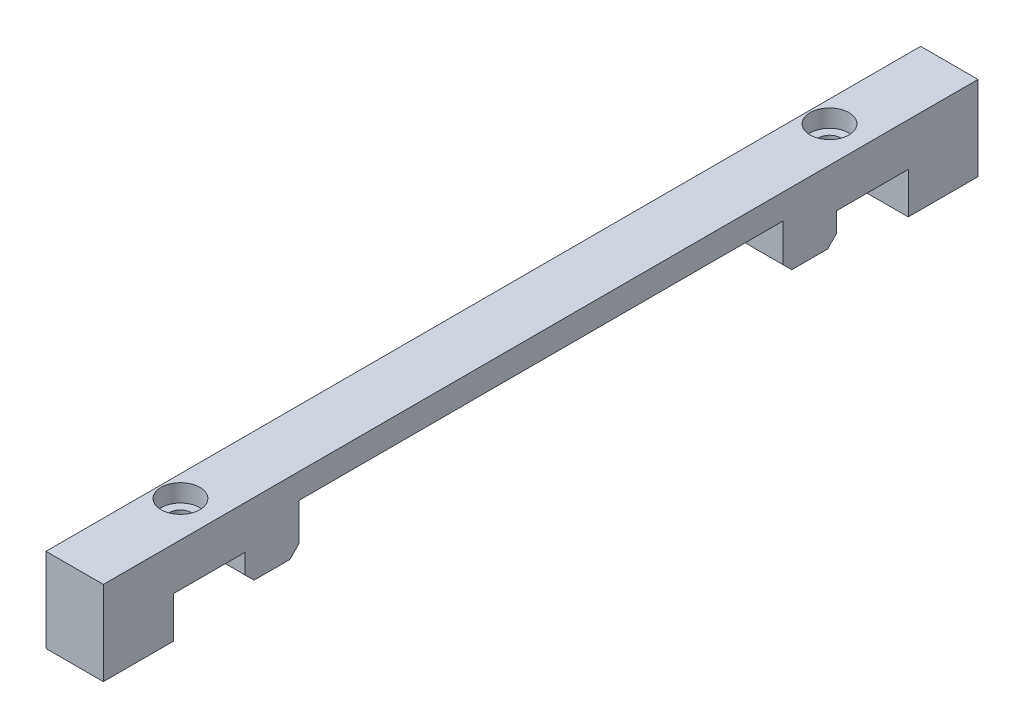
ISO-10303-21;
HEADER;
FILE_DESCRIPTION(('STEP AP214'),'2;1');
FILE_NAME('part.step','',(''),(''),'','','');
FILE_SCHEMA(('AUTOMOTIVE_DESIGN { 1 0 10303 214 1 1 1 1 }'));
ENDSEC;
DATA;
#1=APPLICATION_CONTEXT('core data for automotive mechanical design processes');
#2=APPLICATION_PROTOCOL_DEFINITION('international standard','automotive_design',2000,#1);
#3=PRODUCT_CONTEXT('',#1,'mechanical');
#4=PRODUCT('Part','Part','',(#3));
#5=PRODUCT_RELATED_PRODUCT_CATEGORY('part','',(#4));
#6=PRODUCT_DEFINITION_FORMATION('','',#4);
#7=PRODUCT_DEFINITION_CONTEXT('part definition',#1,'design');
#8=PRODUCT_DEFINITION('design','',#6,#7);
#9=PRODUCT_DEFINITION_SHAPE('','',#8);
#10=(LENGTH_UNIT() NAMED_UNIT(*) SI_UNIT(.MILLI.,.METRE.));
#11=(NAMED_UNIT(*) PLANE_ANGLE_UNIT() SI_UNIT($,.RADIAN.));
#12=(NAMED_UNIT(*) SI_UNIT($,.STERADIAN.) SOLID_ANGLE_UNIT());
#13=UNCERTAINTY_MEASURE_WITH_UNIT(LENGTH_MEASURE(1.E-05),#10,'distance_accuracy_value','');
#14=(GEOMETRIC_REPRESENTATION_CONTEXT(3) GLOBAL_UNCERTAINTY_ASSIGNED_CONTEXT((#13)) GLOBAL_UNIT_ASSIGNED_CONTEXT((#10,
#11,#12)) REPRESENTATION_CONTEXT('',''));
#15=CARTESIAN_POINT('',(0.,0.,0.));
#16=DIRECTION('',(0.,0.,1.));
#17=DIRECTION('',(1.,0.,0.));
#18=AXIS2_PLACEMENT_3D('',#15,#16,#17);
#19=CARTESIAN_POINT('',(4.06399999999999,18.288,-63.5));
#20=DIRECTION('',(-1.,0.,0.));
#21=DIRECTION('',(0.,0.,1.));
#22=AXIS2_PLACEMENT_3D('',#19,#20,#21);
#23=PLANE('',#22);
#24=DIRECTION('',(0.,0.,-1.));
#25=VECTOR('',#24,1.);
#26=CARTESIAN_POINT('',(4.06399999999999,18.288,-63.5));
#27=LINE('',#26,#25);
#28=CARTESIAN_POINT('',(4.06399999999999,18.288,61.9922717194262));
#29=VERTEX_POINT('',#28);
#30=CARTESIAN_POINT('',(4.06399999999999,18.288,-61.9535592267789));
#31=VERTEX_POINT('',#30);
#32=EDGE_CURVE('E207',#29,#31,#27,.T.);
#33=ORIENTED_EDGE('',*,*,#32,.F.);
#34=DIRECTION('',(0.,-1.,0.));
#35=VECTOR('',#34,1.);
#36=CARTESIAN_POINT('',(4.06399999999999,18.288,61.9922717194262));
#37=LINE('',#36,#35);
#38=CARTESIAN_POINT('',(4.06399999999999,6.35,61.9922717194262));
#39=VERTEX_POINT('',#38);
#40=EDGE_CURVE('E187',#29,#39,#37,.T.);
#41=ORIENTED_EDGE('',*,*,#40,.T.);
#42=DIRECTION('',(0.,0.,1.));
#43=VECTOR('',#42,1.);
#44=CARTESIAN_POINT('',(4.06399999999999,6.35,63.5));
#45=LINE('',#44,#43);
#46=CARTESIAN_POINT('',(4.06399999999999,6.35,52.07));
#47=VERTEX_POINT('',#46);
#48=EDGE_CURVE('E728',#47,#39,#45,.T.);
#49=ORIENTED_EDGE('',*,*,#48,.F.);
#50=DIRECTION('',(0.,-1.,0.));
#51=VECTOR('',#50,1.);
#52=CARTESIAN_POINT('',(4.06400000000001,8.128,52.07));
#53=LINE('',#52,#51);
#54=CARTESIAN_POINT('',(4.06400000000001,12.192,52.07));
#55=VERTEX_POINT('',#54);
#56=EDGE_CURVE('E314',#55,#47,#53,.T.);
#57=ORIENTED_EDGE('',*,*,#56,.F.);
#58=DIRECTION('',(0.,0.,-1.));
#59=VECTOR('',#58,1.);
#60=CARTESIAN_POINT('',(4.06400000000001,12.192,41.91));
#61=LINE('',#60,#59);
#62=CARTESIAN_POINT('',(4.06400000000001,12.192,41.91));
#63=VERTEX_POINT('',#62);
#64=EDGE_CURVE('E340',#55,#63,#61,.T.);
#65=ORIENTED_EDGE('',*,*,#64,.T.);
#66=DIRECTION('',(0.,-1.,0.));
#67=VECTOR('',#66,1.);
#68=CARTESIAN_POINT('',(4.06400000000001,12.192,41.91));
#69=LINE('',#68,#67);
#70=CARTESIAN_POINT('',(4.06400000000001,9.39800000000001,41.91));
#71=VERTEX_POINT('',#70);
#72=EDGE_CURVE('E354',#63,#71,#69,.T.);
#73=ORIENTED_EDGE('',*,*,#72,.T.);
#74=DIRECTION('',(0.,0.707106781186551,0.707106781186544));
#75=VECTOR('',#74,1.);
#76=CARTESIAN_POINT('',(4.064,8.128,40.64));
#77=LINE('',#76,#75);
#78=CARTESIAN_POINT('',(4.06400000000001,8.128,40.64));
#79=VERTEX_POINT('',#78);
#80=EDGE_CURVE('E234',#71,#79,#77,.F.);
#81=ORIENTED_EDGE('',*,*,#80,.T.);
#82=DIRECTION('',(0.,0.,1.));
#83=VECTOR('',#82,1.);
#84=CARTESIAN_POINT('',(4.06400000000001,8.128,52.07));
#85=LINE('',#84,#83);
#86=CARTESIAN_POINT('',(4.06400000000001,8.128,35.56));
#87=VERTEX_POINT('',#86);
#88=EDGE_CURVE('E303',#87,#79,#85,.T.);
#89=ORIENTED_EDGE('',*,*,#88,.F.);
#90=DIRECTION('',(0.,-0.707106781186551,0.707106781186544));
#91=VECTOR('',#90,1.);
#92=CARTESIAN_POINT('',(4.064,8.128,35.56));
#93=LINE('',#92,#91);
#94=CARTESIAN_POINT('',(4.06400000000001,9.39800000000001,34.29));
#95=VERTEX_POINT('',#94);
#96=EDGE_CURVE('E236',#87,#95,#93,.F.);
#97=ORIENTED_EDGE('',*,*,#96,.T.);
#98=DIRECTION('',(0.,-1.,0.));
#99=VECTOR('',#98,1.);
#100=CARTESIAN_POINT('',(4.06400000000001,14.732,34.29));
#101=LINE('',#100,#99);
#102=CARTESIAN_POINT('',(4.06400000000001,14.732,34.29));
#103=VERTEX_POINT('',#102);
#104=EDGE_CURVE('E331',#103,#95,#101,.T.);
#105=ORIENTED_EDGE('',*,*,#104,.F.);
#106=DIRECTION('',(0.,0.,1.));
#107=VECTOR('',#106,1.);
#108=CARTESIAN_POINT('',(4.06400000000001,14.732,0.));
#109=LINE('',#108,#107);
#110=CARTESIAN_POINT('',(4.06400000000001,14.732,-34.29));
#111=VERTEX_POINT('',#110);
#112=EDGE_CURVE('E218',#111,#103,#109,.T.);
#113=ORIENTED_EDGE('',*,*,#112,.F.);
#114=DIRECTION('',(0.,-1.,0.));
#115=VECTOR('',#114,1.);
#116=CARTESIAN_POINT('',(4.06400000000001,14.732,-34.29));
#117=LINE('',#116,#115);
#118=CARTESIAN_POINT('',(4.06400000000001,9.39800000000002,-34.29));
#119=VERTEX_POINT('',#118);
#120=EDGE_CURVE('E276',#111,#119,#117,.T.);
#121=ORIENTED_EDGE('',*,*,#120,.T.);
#122=DIRECTION('',(0.,-0.707106781186544,-0.707106781186551));
#123=VECTOR('',#122,1.);
#124=CARTESIAN_POINT('',(4.06400000000001,9.39800000000002,-34.29));
#125=LINE('',#124,#123);
#126=CARTESIAN_POINT('',(4.06400000000001,8.128,-35.56));
#127=VERTEX_POINT('',#126);
#128=EDGE_CURVE('E232',#119,#127,#125,.T.);
#129=ORIENTED_EDGE('',*,*,#128,.T.);
#130=CARTESIAN_POINT('',(4.06400000000001,8.128,-40.64));
#131=VERTEX_POINT('',#130);
#132=EDGE_CURVE('E262',#131,#127,#85,.T.);
#133=ORIENTED_EDGE('',*,*,#132,.F.);
#134=DIRECTION('',(0.,0.707106781186544,-0.707106781186551));
#135=VECTOR('',#134,1.);
#136=CARTESIAN_POINT('',(4.064,9.39800000000002,-41.91));
#137=LINE('',#136,#135);
#138=CARTESIAN_POINT('',(4.06400000000001,9.39800000000002,-41.91));
#139=VERTEX_POINT('',#138);
#140=EDGE_CURVE('E230',#131,#139,#137,.T.);
#141=ORIENTED_EDGE('',*,*,#140,.T.);
#142=DIRECTION('',(0.,-1.,0.));
#143=VECTOR('',#142,1.);
#144=CARTESIAN_POINT('',(4.06400000000001,12.192,-41.91));
#145=LINE('',#144,#143);
#146=CARTESIAN_POINT('',(4.06400000000001,12.192,-41.91));
#147=VERTEX_POINT('',#146);
#148=EDGE_CURVE('E300',#147,#139,#145,.T.);
#149=ORIENTED_EDGE('',*,*,#148,.F.);
#150=DIRECTION('',(0.,0.,1.));
#151=VECTOR('',#150,1.);
#152=CARTESIAN_POINT('',(4.06400000000001,12.192,-41.91));
#153=LINE('',#152,#151);
#154=CARTESIAN_POINT('',(4.06400000000001,12.192,-52.07));
#155=VERTEX_POINT('',#154);
#156=EDGE_CURVE('E282',#155,#147,#153,.T.);
#157=ORIENTED_EDGE('',*,*,#156,.F.);
#158=DIRECTION('',(0.,-1.,0.));
#159=VECTOR('',#158,1.);
#160=CARTESIAN_POINT('',(4.06400000000001,8.128,-52.07));
#161=LINE('',#160,#159);
#162=CARTESIAN_POINT('',(4.06400000000001,6.35,-52.07));
#163=VERTEX_POINT('',#162);
#164=EDGE_CURVE('E211',#155,#163,#161,.T.);
#165=ORIENTED_EDGE('',*,*,#164,.T.);
#166=CARTESIAN_POINT('',(4.06399999999999,6.35,-61.9535592267789));
#167=VERTEX_POINT('',#166);
#168=EDGE_CURVE('E430',#167,#163,#45,.T.);
#169=ORIENTED_EDGE('',*,*,#168,.F.);
#170=DIRECTION('',(0.,-1.,0.));
#171=VECTOR('',#170,1.);
#172=CARTESIAN_POINT('',(4.06399999999999,18.288,-61.9535592267789));
#173=LINE('',#172,#171);
#174=EDGE_CURVE('E65',#31,#167,#173,.T.);
#175=ORIENTED_EDGE('',*,*,#174,.F.);
#176=EDGE_LOOP('',(#33,#41,#49,#57,#65,#73,#81,#89,#97,#105,#113,#121,#129,#133,#141,#149,#157,
#165,#169,#175));
#177=FACE_BOUND('',#176,.T.);
#178=ADVANCED_FACE('F40',(#177),#23,.F.);
#179=CARTESIAN_POINT('',(-4.06400000000001,18.288,-63.5));
#180=DIRECTION('',(1.,0.,0.));
#181=DIRECTION('',(0.,0.,-1.));
#182=AXIS2_PLACEMENT_3D('',#179,#180,#181);
#183=PLANE('',#182);
#184=DIRECTION('',(0.,0.,-1.));
#185=VECTOR('',#184,1.);
#186=CARTESIAN_POINT('',(-4.06399999999999,6.35,63.5));
#187=LINE('',#186,#185);
#188=CARTESIAN_POINT('',(-4.06399999999999,6.35,61.9922717194262));
#189=VERTEX_POINT('',#188);
#190=CARTESIAN_POINT('',(-4.06400000000001,6.35,52.07));
#191=VERTEX_POINT('',#190);
#192=EDGE_CURVE('E200',#189,#191,#187,.T.);
#193=ORIENTED_EDGE('',*,*,#192,.F.);
#194=DIRECTION('',(0.,-1.,0.));
#195=VECTOR('',#194,1.);
#196=CARTESIAN_POINT('',(-4.06399999999999,18.288,61.9922717194262));
#197=LINE('',#196,#195);
#198=CARTESIAN_POINT('',(-4.06399999999999,18.288,61.9922717194262));
#199=VERTEX_POINT('',#198);
#200=EDGE_CURVE('E57',#199,#189,#197,.T.);
#201=ORIENTED_EDGE('',*,*,#200,.F.);
#202=DIRECTION('',(0.,0.,1.));
#203=VECTOR('',#202,1.);
#204=CARTESIAN_POINT('',(-4.06400000000001,18.288,-63.5));
#205=LINE('',#204,#203);
#206=CARTESIAN_POINT('',(-4.06399999999999,18.288,-61.9535592267789));
#207=VERTEX_POINT('',#206);
#208=EDGE_CURVE('E198',#207,#199,#205,.T.);
#209=ORIENTED_EDGE('',*,*,#208,.F.);
#210=DIRECTION('',(0.,-1.,0.));
#211=VECTOR('',#210,1.);
#212=CARTESIAN_POINT('',(-4.06399999999999,18.288,-61.9535592267789));
#213=LINE('',#212,#211);
#214=CARTESIAN_POINT('',(-4.06399999999999,6.35,-61.9535592267789));
#215=VERTEX_POINT('',#214);
#216=EDGE_CURVE('E742',#207,#215,#213,.T.);
#217=ORIENTED_EDGE('',*,*,#216,.T.);
#218=CARTESIAN_POINT('',(-4.06399999999999,6.35,-52.07));
#219=VERTEX_POINT('',#218);
#220=EDGE_CURVE('E730',#219,#215,#187,.T.);
#221=ORIENTED_EDGE('',*,*,#220,.F.);
#222=DIRECTION('',(0.,-1.,0.));
#223=VECTOR('',#222,1.);
#224=CARTESIAN_POINT('',(-4.06400000000001,8.128,-52.07));
#225=LINE('',#224,#223);
#226=CARTESIAN_POINT('',(-4.06400000000001,12.192,-52.07));
#227=VERTEX_POINT('',#226);
#228=EDGE_CURVE('E310',#227,#219,#225,.T.);
#229=ORIENTED_EDGE('',*,*,#228,.F.);
#230=DIRECTION('',(0.,0.,-1.));
#231=VECTOR('',#230,1.);
#232=CARTESIAN_POINT('',(-4.06400000000001,12.192,-41.91));
#233=LINE('',#232,#231);
#234=CARTESIAN_POINT('',(-4.06400000000001,12.192,-41.91));
#235=VERTEX_POINT('',#234);
#236=EDGE_CURVE('E294',#235,#227,#233,.T.);
#237=ORIENTED_EDGE('',*,*,#236,.F.);
#238=DIRECTION('',(0.,-1.,0.));
#239=VECTOR('',#238,1.);
#240=CARTESIAN_POINT('',(-4.06400000000001,12.192,-41.91));
#241=LINE('',#240,#239);
#242=CARTESIAN_POINT('',(-4.06400000000001,9.39800000000002,-41.91));
#243=VERTEX_POINT('',#242);
#244=EDGE_CURVE('E301',#235,#243,#241,.T.);
#245=ORIENTED_EDGE('',*,*,#244,.T.);
#246=DIRECTION('',(0.,-0.707106781186544,0.707106781186551));
#247=VECTOR('',#246,1.);
#248=CARTESIAN_POINT('',(-4.06400000000001,9.39800000000002,-41.91));
#249=LINE('',#248,#247);
#250=CARTESIAN_POINT('',(-4.06400000000001,8.128,-40.64));
#251=VERTEX_POINT('',#250);
#252=EDGE_CURVE('E206',#243,#251,#249,.T.);
#253=ORIENTED_EDGE('',*,*,#252,.T.);
#254=DIRECTION('',(0.,0.,-1.));
#255=VECTOR('',#254,1.);
#256=CARTESIAN_POINT('',(-4.06400000000001,8.128,52.07));
#257=LINE('',#256,#255);
#258=CARTESIAN_POINT('',(-4.06400000000001,8.128,-35.56));
#259=VERTEX_POINT('',#258);
#260=EDGE_CURVE('E259',#259,#251,#257,.T.);
#261=ORIENTED_EDGE('',*,*,#260,.F.);
#262=DIRECTION('',(0.,0.707106781186544,0.707106781186551));
#263=VECTOR('',#262,1.);
#264=CARTESIAN_POINT('',(-4.064,9.39800000000002,-34.29));
#265=LINE('',#264,#263);
#266=CARTESIAN_POINT('',(-4.06400000000001,9.39800000000002,-34.29));
#267=VERTEX_POINT('',#266);
#268=EDGE_CURVE('E209',#259,#267,#265,.T.);
#269=ORIENTED_EDGE('',*,*,#268,.T.);
#270=DIRECTION('',(0.,-1.,0.));
#271=VECTOR('',#270,1.);
#272=CARTESIAN_POINT('',(-4.06400000000001,14.732,-34.29));
#273=LINE('',#272,#271);
#274=CARTESIAN_POINT('',(-4.06400000000001,14.732,-34.29));
#275=VERTEX_POINT('',#274);
#276=EDGE_CURVE('E278',#275,#267,#273,.T.);
#277=ORIENTED_EDGE('',*,*,#276,.F.);
#278=DIRECTION('',(0.,0.,-1.));
#279=VECTOR('',#278,1.);
#280=CARTESIAN_POINT('',(-4.06400000000001,14.732,0.));
#281=LINE('',#280,#279);
#282=CARTESIAN_POINT('',(-4.06400000000001,14.732,34.29));
#283=VERTEX_POINT('',#282);
#284=EDGE_CURVE('E367',#283,#275,#281,.T.);
#285=ORIENTED_EDGE('',*,*,#284,.F.);
#286=DIRECTION('',(0.,-1.,0.));
#287=VECTOR('',#286,1.);
#288=CARTESIAN_POINT('',(-4.06400000000001,14.732,34.29));
#289=LINE('',#288,#287);
#290=CARTESIAN_POINT('',(-4.06400000000001,9.39800000000001,34.29));
#291=VERTEX_POINT('',#290);
#292=EDGE_CURVE('E338',#283,#291,#289,.T.);
#293=ORIENTED_EDGE('',*,*,#292,.T.);
#294=DIRECTION('',(0.,0.707106781186551,-0.707106781186544));
#295=VECTOR('',#294,1.);
#296=CARTESIAN_POINT('',(-4.064,8.128,35.56));
#297=LINE('',#296,#295);
#298=CARTESIAN_POINT('',(-4.06400000000001,8.128,35.56));
#299=VERTEX_POINT('',#298);
#300=EDGE_CURVE('E228',#291,#299,#297,.F.);
#301=ORIENTED_EDGE('',*,*,#300,.T.);
#302=CARTESIAN_POINT('',(-4.06400000000001,8.128,40.64));
#303=VERTEX_POINT('',#302);
#304=EDGE_CURVE('E268',#303,#299,#257,.T.);
#305=ORIENTED_EDGE('',*,*,#304,.F.);
#306=DIRECTION('',(0.,-0.707106781186551,-0.707106781186544));
#307=VECTOR('',#306,1.);
#308=CARTESIAN_POINT('',(-4.06399999999999,8.128,40.64));
#309=LINE('',#308,#307);
#310=CARTESIAN_POINT('',(-4.06400000000001,9.39800000000001,41.91));
#311=VERTEX_POINT('',#310);
#312=EDGE_CURVE('E226',#303,#311,#309,.F.);
#313=ORIENTED_EDGE('',*,*,#312,.T.);
#314=DIRECTION('',(0.,-1.,0.));
#315=VECTOR('',#314,1.);
#316=CARTESIAN_POINT('',(-4.06400000000001,12.192,41.91));
#317=LINE('',#316,#315);
#318=CARTESIAN_POINT('',(-4.06400000000001,12.192,41.91));
#319=VERTEX_POINT('',#318);
#320=EDGE_CURVE('E353',#319,#311,#317,.T.);
#321=ORIENTED_EDGE('',*,*,#320,.F.);
#322=DIRECTION('',(0.,0.,1.));
#323=VECTOR('',#322,1.);
#324=CARTESIAN_POINT('',(-4.06400000000001,12.192,41.91));
#325=LINE('',#324,#323);
#326=CARTESIAN_POINT('',(-4.06400000000001,12.192,52.07));
#327=VERTEX_POINT('',#326);
#328=EDGE_CURVE('E348',#319,#327,#325,.T.);
#329=ORIENTED_EDGE('',*,*,#328,.T.);
#330=DIRECTION('',(0.,-1.,0.));
#331=VECTOR('',#330,1.);
#332=CARTESIAN_POINT('',(-4.06400000000001,8.128,52.07));
#333=LINE('',#332,#331);
#334=EDGE_CURVE('E313',#327,#191,#333,.T.);
#335=ORIENTED_EDGE('',*,*,#334,.T.);
#336=EDGE_LOOP('',(#193,#201,#209,#217,#221,#229,#237,#245,#253,#261,#269,#277,#285,#293,#301,
#305,#313,#321,#329,#335));
#337=FACE_BOUND('',#336,.T.);
#338=ADVANCED_FACE('F196',(#337),#183,.F.);
#339=CARTESIAN_POINT('',(-4.06400000000001,8.128,-52.07));
#340=DIRECTION('',(0.,0.,-1.));
#341=DIRECTION('',(-1.,0.,0.));
#342=AXIS2_PLACEMENT_3D('',#339,#340,#341);
#343=PLANE('',#342);
#344=DIRECTION('',(-1.,0.,0.));
#345=VECTOR('',#344,1.);
#346=CARTESIAN_POINT('',(-4.06400000000001,6.35,-52.07));
#347=LINE('',#346,#345);
#348=EDGE_CURVE('E433',#163,#219,#347,.T.);
#349=ORIENTED_EDGE('',*,*,#348,.F.);
#350=ORIENTED_EDGE('',*,*,#164,.F.);
#351=DIRECTION('',(1.,0.,0.));
#352=VECTOR('',#351,1.);
#353=CARTESIAN_POINT('',(-4.06400000000001,12.192,-52.07));
#354=LINE('',#353,#352);
#355=EDGE_CURVE('E297',#227,#155,#354,.T.);
#356=ORIENTED_EDGE('',*,*,#355,.F.);
#357=ORIENTED_EDGE('',*,*,#228,.T.);
#358=EDGE_LOOP('',(#349,#350,#356,#357));
#359=FACE_BOUND('',#358,.T.);
#360=ADVANCED_FACE('F388',(#359),#343,.F.);
#361=CARTESIAN_POINT('',(-4.06400000000001,8.128,52.07));
#362=DIRECTION('',(0.,0.,1.));
#363=DIRECTION('',(1.,0.,0.));
#364=AXIS2_PLACEMENT_3D('',#361,#362,#363);
#365=PLANE('',#364);
#366=DIRECTION('',(1.,0.,0.));
#367=VECTOR('',#366,1.);
#368=CARTESIAN_POINT('',(-4.06400000000001,6.35,52.07));
#369=LINE('',#368,#367);
#370=EDGE_CURVE('E438',#191,#47,#369,.T.);
#371=ORIENTED_EDGE('',*,*,#370,.F.);
#372=ORIENTED_EDGE('',*,*,#334,.F.);
#373=DIRECTION('',(1.,0.,0.));
#374=VECTOR('',#373,1.);
#375=CARTESIAN_POINT('',(-4.06400000000001,12.192,52.07));
#376=LINE('',#375,#374);
#377=EDGE_CURVE('E346',#327,#55,#376,.T.);
#378=ORIENTED_EDGE('',*,*,#377,.T.);
#379=ORIENTED_EDGE('',*,*,#56,.T.);
#380=EDGE_LOOP('',(#371,#372,#378,#379));
#381=FACE_BOUND('',#380,.T.);
#382=ADVANCED_FACE('F575',(#381),#365,.F.);
#383=CARTESIAN_POINT('',(0.,8.128,0.));
#384=DIRECTION('',(0.,-1.,0.));
#385=DIRECTION('',(0.,0.,-1.));
#386=AXIS2_PLACEMENT_3D('',#383,#384,#385);
#387=PLANE('',#386);
#388=ORIENTED_EDGE('',*,*,#304,.T.);
#389=DIRECTION('',(1.,0.,0.));
#390=VECTOR('',#389,1.);
#391=CARTESIAN_POINT('',(0.,8.128,35.56));
#392=LINE('',#391,#390);
#393=EDGE_CURVE('E241',#299,#87,#392,.T.);
#394=ORIENTED_EDGE('',*,*,#393,.T.);
#395=ORIENTED_EDGE('',*,*,#88,.T.);
#396=DIRECTION('',(-1.,0.,0.));
#397=VECTOR('',#396,1.);
#398=CARTESIAN_POINT('',(0.,8.128,40.64));
#399=LINE('',#398,#397);
#400=EDGE_CURVE('E238',#79,#303,#399,.T.);
#401=ORIENTED_EDGE('',*,*,#400,.T.);
#402=EDGE_LOOP('',(#388,#394,#395,#401));
#403=FACE_BOUND('',#402,.T.);
#404=ADVANCED_FACE('F323',(#403),#387,.T.);
#405=ORIENTED_EDGE('',*,*,#132,.T.);
#406=DIRECTION('',(-1.,0.,0.));
#407=VECTOR('',#406,1.);
#408=CARTESIAN_POINT('',(-4.06400000000001,8.128,-35.56));
#409=LINE('',#408,#407);
#410=EDGE_CURVE('E50',#127,#259,#409,.T.);
#411=ORIENTED_EDGE('',*,*,#410,.T.);
#412=ORIENTED_EDGE('',*,*,#260,.T.);
#413=DIRECTION('',(1.,0.,0.));
#414=VECTOR('',#413,1.);
#415=CARTESIAN_POINT('',(4.06400000000001,8.128,-40.64));
#416=LINE('',#415,#414);
#417=EDGE_CURVE('E251',#251,#131,#416,.T.);
#418=ORIENTED_EDGE('',*,*,#417,.T.);
#419=EDGE_LOOP('',(#405,#411,#412,#418));
#420=FACE_BOUND('',#419,.T.);
#421=ADVANCED_FACE('F258',(#420),#387,.T.);
#422=CARTESIAN_POINT('',(0.,18.288,0.));
#423=DIRECTION('',(0.,1.,0.));
#424=DIRECTION('',(0.,0.,1.));
#425=AXIS2_PLACEMENT_3D('',#422,#423,#424);
#426=PLANE('',#425);
#427=DIRECTION('',(1.,0.,0.));
#428=VECTOR('',#427,1.);
#429=CARTESIAN_POINT('',(4.06399999999999,18.288,61.9922717194262));
#430=LINE('',#429,#428);
#431=EDGE_CURVE('E184',#199,#29,#430,.T.);
#432=ORIENTED_EDGE('',*,*,#431,.T.);
#433=ORIENTED_EDGE('',*,*,#32,.T.);
#434=DIRECTION('',(-1.,0.,0.));
#435=VECTOR('',#434,1.);
#436=CARTESIAN_POINT('',(4.06399999999999,18.288,-61.9535592267789));
#437=LINE('',#436,#435);
#438=EDGE_CURVE('E205',#31,#207,#437,.T.);
#439=ORIENTED_EDGE('',*,*,#438,.T.);
#440=ORIENTED_EDGE('',*,*,#208,.T.);
#441=EDGE_LOOP('',(#432,#433,#439,#440));
#442=FACE_BOUND('',#441,.T.);
#443=CARTESIAN_POINT('',(-1.01599999999999,18.288,45.99));
#444=DIRECTION('',(0.,1.,0.));
#445=DIRECTION('',(0.,0.,1.));
#446=AXIS2_PLACEMENT_3D('',#443,#444,#445);
#447=CIRCLE('',#446,2.75);
#448=CARTESIAN_POINT('',(-1.01599999999999,18.288,48.74));
#449=VERTEX_POINT('',#448);
#450=EDGE_CURVE('E449',#449,#449,#447,.T.);
#451=ORIENTED_EDGE('',*,*,#450,.F.);
#452=EDGE_LOOP('',(#451));
#453=FACE_BOUND('',#452,.T.);
#454=CARTESIAN_POINT('',(-1.01599999999999,18.288,-45.99));
#455=DIRECTION('',(0.,1.,0.));
#456=DIRECTION('',(0.,0.,1.));
#457=AXIS2_PLACEMENT_3D('',#454,#455,#456);
#458=CIRCLE('',#457,2.75);
#459=CARTESIAN_POINT('',(-1.01599999999999,18.288,-43.24));
#460=VERTEX_POINT('',#459);
#461=EDGE_CURVE('E357',#460,#460,#458,.T.);
#462=ORIENTED_EDGE('',*,*,#461,.F.);
#463=EDGE_LOOP('',(#462));
#464=FACE_BOUND('',#463,.T.);
#465=ADVANCED_FACE('F203',(#442,#453,#464),#426,.T.);
#466=CARTESIAN_POINT('',(-4.06400000000001,12.192,-41.91));
#467=DIRECTION('',(0.,0.,1.));
#468=DIRECTION('',(1.,0.,0.));
#469=AXIS2_PLACEMENT_3D('',#466,#467,#468);
#470=PLANE('',#469);
#471=ORIENTED_EDGE('',*,*,#148,.T.);
#472=DIRECTION('',(-1.,0.,0.));
#473=VECTOR('',#472,1.);
#474=CARTESIAN_POINT('',(-4.06400000000001,9.39800000000002,-41.91));
#475=LINE('',#474,#473);
#476=EDGE_CURVE('E11',#139,#243,#475,.T.);
#477=ORIENTED_EDGE('',*,*,#476,.T.);
#478=ORIENTED_EDGE('',*,*,#244,.F.);
#479=DIRECTION('',(-1.,0.,0.));
#480=VECTOR('',#479,1.);
#481=CARTESIAN_POINT('',(-4.06400000000001,12.192,-41.91));
#482=LINE('',#481,#480);
#483=EDGE_CURVE('E285',#147,#235,#482,.T.);
#484=ORIENTED_EDGE('',*,*,#483,.F.);
#485=EDGE_LOOP('',(#471,#477,#478,#484));
#486=FACE_BOUND('',#485,.T.);
#487=ADVANCED_FACE('F425',(#486),#470,.F.);
#488=CARTESIAN_POINT('',(0.,12.192,0.));
#489=DIRECTION('',(0.,-1.,0.));
#490=DIRECTION('',(0.,0.,-1.));
#491=AXIS2_PLACEMENT_3D('',#488,#489,#490);
#492=PLANE('',#491);
#493=CARTESIAN_POINT('',(-1.01599999999999,12.192,-45.99));
#494=DIRECTION('',(0.,-1.,0.));
#495=DIRECTION('',(0.,0.,-1.));
#496=AXIS2_PLACEMENT_3D('',#493,#494,#495);
#497=CIRCLE('',#496,1.55);
#498=CARTESIAN_POINT('',(-1.01599999999999,12.192,-47.54));
#499=VERTEX_POINT('',#498);
#500=EDGE_CURVE('E215',#499,#499,#497,.T.);
#501=ORIENTED_EDGE('',*,*,#500,.F.);
#502=EDGE_LOOP('',(#501));
#503=FACE_BOUND('',#502,.T.);
#504=ORIENTED_EDGE('',*,*,#156,.T.);
#505=ORIENTED_EDGE('',*,*,#483,.T.);
#506=ORIENTED_EDGE('',*,*,#236,.T.);
#507=ORIENTED_EDGE('',*,*,#355,.T.);
#508=EDGE_LOOP('',(#504,#505,#506,#507));
#509=FACE_BOUND('',#508,.T.);
#510=ADVANCED_FACE('F380',(#503,#509),#492,.T.);
#511=CARTESIAN_POINT('',(4.06400000000001,14.732,-34.29));
#512=DIRECTION('',(0.,0.,-1.));
#513=DIRECTION('',(-1.,0.,0.));
#514=AXIS2_PLACEMENT_3D('',#511,#512,#513);
#515=PLANE('',#514);
#516=ORIENTED_EDGE('',*,*,#276,.T.);
#517=DIRECTION('',(1.,0.,0.));
#518=VECTOR('',#517,1.);
#519=CARTESIAN_POINT('',(4.06400000000001,9.39800000000002,-34.29));
#520=LINE('',#519,#518);
#521=EDGE_CURVE('E248',#267,#119,#520,.T.);
#522=ORIENTED_EDGE('',*,*,#521,.T.);
#523=ORIENTED_EDGE('',*,*,#120,.F.);
#524=DIRECTION('',(1.,0.,0.));
#525=VECTOR('',#524,1.);
#526=CARTESIAN_POINT('',(4.06400000000001,14.732,-34.29));
#527=LINE('',#526,#525);
#528=EDGE_CURVE('E287',#275,#111,#527,.T.);
#529=ORIENTED_EDGE('',*,*,#528,.F.);
#530=EDGE_LOOP('',(#516,#522,#523,#529));
#531=FACE_BOUND('',#530,.T.);
#532=ADVANCED_FACE('F274',(#531),#515,.F.);
#533=CARTESIAN_POINT('',(0.,14.732,0.));
#534=DIRECTION('',(0.,1.,0.));
#535=DIRECTION('',(0.,0.,1.));
#536=AXIS2_PLACEMENT_3D('',#533,#534,#535);
#537=PLANE('',#536);
#538=ORIENTED_EDGE('',*,*,#112,.T.);
#539=DIRECTION('',(1.,0.,0.));
#540=VECTOR('',#539,1.);
#541=CARTESIAN_POINT('',(4.06400000000001,14.732,34.29));
#542=LINE('',#541,#540);
#543=EDGE_CURVE('E222',#283,#103,#542,.T.);
#544=ORIENTED_EDGE('',*,*,#543,.F.);
#545=ORIENTED_EDGE('',*,*,#284,.T.);
#546=ORIENTED_EDGE('',*,*,#528,.T.);
#547=EDGE_LOOP('',(#538,#544,#545,#546));
#548=FACE_BOUND('',#547,.T.);
#549=ADVANCED_FACE('F369',(#548),#537,.F.);
#550=CARTESIAN_POINT('',(-1.01599999999999,18.288,-45.99));
#551=DIRECTION('',(0.,1.,0.));
#552=DIRECTION('',(0.,0.,1.));
#553=AXIS2_PLACEMENT_3D('',#550,#551,#552);
#554=CYLINDRICAL_SURFACE('',#553,1.55);
#555=ORIENTED_EDGE('',*,*,#500,.T.);
#556=EDGE_LOOP('',(#555));
#557=FACE_BOUND('',#556,.T.);
#558=CARTESIAN_POINT('',(-1.01599999999999,15.788,-45.99));
#559=DIRECTION('',(0.,1.,0.));
#560=DIRECTION('',(0.,0.,1.));
#561=AXIS2_PLACEMENT_3D('',#558,#559,#560);
#562=CIRCLE('',#561,1.55);
#563=CARTESIAN_POINT('',(-1.01599999999999,15.788,-44.44));
#564=VERTEX_POINT('',#563);
#565=EDGE_CURVE('E219',#564,#564,#562,.T.);
#566=ORIENTED_EDGE('',*,*,#565,.T.);
#567=EDGE_LOOP('',(#566));
#568=FACE_BOUND('',#567,.T.);
#569=ADVANCED_FACE('F371',(#557,#568),#554,.F.);
#570=CARTESIAN_POINT('',(0.534000000000008,15.788,-45.99));
#571=DIRECTION('',(0.,-1.,0.));
#572=DIRECTION('',(0.,0.,-1.));
#573=AXIS2_PLACEMENT_3D('',#570,#571,#572);
#574=PLANE('',#573);
#575=ORIENTED_EDGE('',*,*,#565,.F.);
#576=EDGE_LOOP('',(#575));
#577=FACE_BOUND('',#576,.T.);
#578=CARTESIAN_POINT('',(-1.01599999999999,15.788,-45.99));
#579=DIRECTION('',(0.,1.,0.));
#580=DIRECTION('',(0.,0.,1.));
#581=AXIS2_PLACEMENT_3D('',#578,#579,#580);
#582=CIRCLE('',#581,2.75);
#583=CARTESIAN_POINT('',(-1.01599999999999,15.788,-43.24));
#584=VERTEX_POINT('',#583);
#585=EDGE_CURVE('E362',#584,#584,#582,.T.);
#586=ORIENTED_EDGE('',*,*,#585,.T.);
#587=EDGE_LOOP('',(#586));
#588=FACE_BOUND('',#587,.T.);
#589=ADVANCED_FACE('F377',(#577,#588),#574,.F.);
#590=CARTESIAN_POINT('',(-1.01599999999999,18.288,-45.99));
#591=DIRECTION('',(0.,1.,0.));
#592=DIRECTION('',(0.,0.,1.));
#593=AXIS2_PLACEMENT_3D('',#590,#591,#592);
#594=CYLINDRICAL_SURFACE('',#593,2.75);
#595=ORIENTED_EDGE('',*,*,#585,.F.);
#596=EDGE_LOOP('',(#595));
#597=FACE_BOUND('',#596,.T.);
#598=ORIENTED_EDGE('',*,*,#461,.T.);
#599=EDGE_LOOP('',(#598));
#600=FACE_BOUND('',#599,.T.);
#601=ADVANCED_FACE('F474',(#597,#600),#594,.F.);
#602=CARTESIAN_POINT('',(-4.06400000000001,12.192,41.91));
#603=DIRECTION('',(0.,0.,1.));
#604=DIRECTION('',(1.,0.,0.));
#605=AXIS2_PLACEMENT_3D('',#602,#603,#604);
#606=PLANE('',#605);
#607=ORIENTED_EDGE('',*,*,#320,.T.);
#608=DIRECTION('',(1.,0.,0.));
#609=VECTOR('',#608,1.);
#610=CARTESIAN_POINT('',(-4.06400000000001,9.39800000000001,41.91));
#611=LINE('',#610,#609);
#612=EDGE_CURVE('E246',#311,#71,#611,.T.);
#613=ORIENTED_EDGE('',*,*,#612,.T.);
#614=ORIENTED_EDGE('',*,*,#72,.F.);
#615=DIRECTION('',(-1.,0.,0.));
#616=VECTOR('',#615,1.);
#617=CARTESIAN_POINT('',(-4.06400000000001,12.192,41.91));
#618=LINE('',#617,#616);
#619=EDGE_CURVE('E351',#63,#319,#618,.T.);
#620=ORIENTED_EDGE('',*,*,#619,.T.);
#621=EDGE_LOOP('',(#607,#613,#614,#620));
#622=FACE_BOUND('',#621,.T.);
#623=ADVANCED_FACE('F476',(#622),#606,.T.);
#624=CARTESIAN_POINT('',(0.,12.192,0.));
#625=DIRECTION('',(0.,-1.,0.));
#626=DIRECTION('',(0.,0.,1.));
#627=AXIS2_PLACEMENT_3D('',#624,#625,#626);
#628=PLANE('',#627);
#629=CARTESIAN_POINT('',(-1.01599999999999,12.192,45.99));
#630=DIRECTION('',(0.,-1.,0.));
#631=DIRECTION('',(0.,0.,-1.));
#632=AXIS2_PLACEMENT_3D('',#629,#630,#631);
#633=CIRCLE('',#632,1.55);
#634=CARTESIAN_POINT('',(-1.01599999999999,12.192,44.44));
#635=VERTEX_POINT('',#634);
#636=EDGE_CURVE('E220',#635,#635,#633,.T.);
#637=ORIENTED_EDGE('',*,*,#636,.F.);
#638=EDGE_LOOP('',(#637));
#639=FACE_BOUND('',#638,.T.);
#640=ORIENTED_EDGE('',*,*,#64,.F.);
#641=ORIENTED_EDGE('',*,*,#377,.F.);
#642=ORIENTED_EDGE('',*,*,#328,.F.);
#643=ORIENTED_EDGE('',*,*,#619,.F.);
#644=EDGE_LOOP('',(#640,#641,#642,#643));
#645=FACE_BOUND('',#644,.T.);
#646=ADVANCED_FACE('F483',(#639,#645),#628,.T.);
#647=CARTESIAN_POINT('',(4.06400000000001,14.732,34.29));
#648=DIRECTION('',(0.,0.,-1.));
#649=DIRECTION('',(-1.,0.,0.));
#650=AXIS2_PLACEMENT_3D('',#647,#648,#649);
#651=PLANE('',#650);
#652=ORIENTED_EDGE('',*,*,#104,.T.);
#653=DIRECTION('',(-1.,0.,0.));
#654=VECTOR('',#653,1.);
#655=CARTESIAN_POINT('',(4.06400000000001,9.39800000000001,34.29));
#656=LINE('',#655,#654);
#657=EDGE_CURVE('E244',#95,#291,#656,.T.);
#658=ORIENTED_EDGE('',*,*,#657,.T.);
#659=ORIENTED_EDGE('',*,*,#292,.F.);
#660=ORIENTED_EDGE('',*,*,#543,.T.);
#661=EDGE_LOOP('',(#652,#658,#659,#660));
#662=FACE_BOUND('',#661,.T.);
#663=ADVANCED_FACE('F334',(#662),#651,.T.);
#664=CARTESIAN_POINT('',(-1.01599999999999,18.288,45.99));
#665=DIRECTION('',(0.,1.,0.));
#666=DIRECTION('',(0.,0.,1.));
#667=AXIS2_PLACEMENT_3D('',#664,#665,#666);
#668=CYLINDRICAL_SURFACE('',#667,1.55);
#669=ORIENTED_EDGE('',*,*,#636,.T.);
#670=EDGE_LOOP('',(#669));
#671=FACE_BOUND('',#670,.T.);
#672=CARTESIAN_POINT('',(-1.01599999999999,15.788,45.99));
#673=DIRECTION('',(0.,1.,0.));
#674=DIRECTION('',(0.,0.,1.));
#675=AXIS2_PLACEMENT_3D('',#672,#673,#674);
#676=CIRCLE('',#675,1.55);
#677=CARTESIAN_POINT('',(-1.01599999999999,15.788,47.54));
#678=VERTEX_POINT('',#677);
#679=EDGE_CURVE('E223',#678,#678,#676,.T.);
#680=ORIENTED_EDGE('',*,*,#679,.T.);
#681=EDGE_LOOP('',(#680));
#682=FACE_BOUND('',#681,.T.);
#683=ADVANCED_FACE('F458',(#671,#682),#668,.F.);
#684=CARTESIAN_POINT('',(0.534000000000008,15.788,45.99));
#685=DIRECTION('',(0.,-1.,0.));
#686=DIRECTION('',(0.,0.,-1.));
#687=AXIS2_PLACEMENT_3D('',#684,#685,#686);
#688=PLANE('',#687);
#689=ORIENTED_EDGE('',*,*,#679,.F.);
#690=EDGE_LOOP('',(#689));
#691=FACE_BOUND('',#690,.T.);
#692=CARTESIAN_POINT('',(-1.01599999999999,15.788,45.99));
#693=DIRECTION('',(0.,1.,0.));
#694=DIRECTION('',(0.,0.,1.));
#695=AXIS2_PLACEMENT_3D('',#692,#693,#694);
#696=CIRCLE('',#695,2.75);
#697=CARTESIAN_POINT('',(-1.01599999999999,15.788,48.74));
#698=VERTEX_POINT('',#697);
#699=EDGE_CURVE('E452',#698,#698,#696,.T.);
#700=ORIENTED_EDGE('',*,*,#699,.T.);
#701=EDGE_LOOP('',(#700));
#702=FACE_BOUND('',#701,.T.);
#703=ADVANCED_FACE('F460',(#691,#702),#688,.F.);
#704=CARTESIAN_POINT('',(-1.01599999999999,18.288,45.99));
#705=DIRECTION('',(0.,1.,0.));
#706=DIRECTION('',(0.,0.,1.));
#707=AXIS2_PLACEMENT_3D('',#704,#705,#706);
#708=CYLINDRICAL_SURFACE('',#707,2.75);
#709=ORIENTED_EDGE('',*,*,#699,.F.);
#710=EDGE_LOOP('',(#709));
#711=FACE_BOUND('',#710,.T.);
#712=ORIENTED_EDGE('',*,*,#450,.T.);
#713=EDGE_LOOP('',(#712));
#714=FACE_BOUND('',#713,.T.);
#715=ADVANCED_FACE('F399',(#711,#714),#708,.F.);
#716=CARTESIAN_POINT('',(0.,8.128,35.56));
#717=DIRECTION('',(0.,0.707106781186544,0.707106781186551));
#718=DIRECTION('',(1.,0.,0.));
#719=AXIS2_PLACEMENT_3D('',#716,#717,#718);
#720=PLANE('',#719);
#721=ORIENTED_EDGE('',*,*,#300,.F.);
#722=ORIENTED_EDGE('',*,*,#657,.F.);
#723=ORIENTED_EDGE('',*,*,#96,.F.);
#724=ORIENTED_EDGE('',*,*,#393,.F.);
#725=EDGE_LOOP('',(#721,#722,#723,#724));
#726=FACE_BOUND('',#725,.T.);
#727=ADVANCED_FACE('F328',(#726),#720,.F.);
#728=CARTESIAN_POINT('',(0.,8.128,40.64));
#729=DIRECTION('',(0.,0.707106781186544,-0.707106781186551));
#730=DIRECTION('',(-1.,0.,0.));
#731=AXIS2_PLACEMENT_3D('',#728,#729,#730);
#732=PLANE('',#731);
#733=ORIENTED_EDGE('',*,*,#80,.F.);
#734=ORIENTED_EDGE('',*,*,#612,.F.);
#735=ORIENTED_EDGE('',*,*,#312,.F.);
#736=ORIENTED_EDGE('',*,*,#400,.F.);
#737=EDGE_LOOP('',(#733,#734,#735,#736));
#738=FACE_BOUND('',#737,.T.);
#739=ADVANCED_FACE('F398',(#738),#732,.F.);
#740=CARTESIAN_POINT('',(4.06400000000001,9.39800000000002,-34.29));
#741=DIRECTION('',(0.,-0.707106781186551,0.707106781186544));
#742=DIRECTION('',(-1.,0.,0.));
#743=AXIS2_PLACEMENT_3D('',#740,#741,#742);
#744=PLANE('',#743);
#745=ORIENTED_EDGE('',*,*,#268,.F.);
#746=ORIENTED_EDGE('',*,*,#410,.F.);
#747=ORIENTED_EDGE('',*,*,#128,.F.);
#748=ORIENTED_EDGE('',*,*,#521,.F.);
#749=EDGE_LOOP('',(#745,#746,#747,#748));
#750=FACE_BOUND('',#749,.T.);
#751=ADVANCED_FACE('F271',(#750),#744,.T.);
#752=CARTESIAN_POINT('',(-4.06400000000001,9.39800000000002,-41.91));
#753=DIRECTION('',(0.,-0.707106781186551,-0.707106781186544));
#754=DIRECTION('',(1.,0.,0.));
#755=AXIS2_PLACEMENT_3D('',#752,#753,#754);
#756=PLANE('',#755);
#757=ORIENTED_EDGE('',*,*,#140,.F.);
#758=ORIENTED_EDGE('',*,*,#417,.F.);
#759=ORIENTED_EDGE('',*,*,#252,.F.);
#760=ORIENTED_EDGE('',*,*,#476,.F.);
#761=EDGE_LOOP('',(#757,#758,#759,#760));
#762=FACE_BOUND('',#761,.T.);
#763=ADVANCED_FACE('F43',(#762),#756,.T.);
#764=CARTESIAN_POINT('',(0.,6.35,0.));
#765=DIRECTION('',(0.,-1.,0.));
#766=DIRECTION('',(0.,0.,-1.));
#767=AXIS2_PLACEMENT_3D('',#764,#765,#766);
#768=PLANE('',#767);
#769=DIRECTION('',(1.,0.,0.));
#770=VECTOR('',#769,1.);
#771=CARTESIAN_POINT('',(4.06399999999999,6.35,61.9922717194262));
#772=LINE('',#771,#770);
#773=EDGE_CURVE('E191',#189,#39,#772,.T.);
#774=ORIENTED_EDGE('',*,*,#773,.F.);
#775=ORIENTED_EDGE('',*,*,#192,.T.);
#776=ORIENTED_EDGE('',*,*,#370,.T.);
#777=ORIENTED_EDGE('',*,*,#48,.T.);
#778=EDGE_LOOP('',(#774,#775,#776,#777));
#779=FACE_BOUND('',#778,.T.);
#780=CARTESIAN_POINT('',(0.,6.35,57.785));
#781=DIRECTION('',(0.,-1.,0.));
#782=DIRECTION('',(0.,0.,-1.));
#783=AXIS2_PLACEMENT_3D('',#780,#781,#782);
#784=CIRCLE('',#783,2.64999999999999);
#785=CARTESIAN_POINT('',(0.,6.35,55.135));
#786=VERTEX_POINT('',#785);
#787=EDGE_CURVE('E45',#786,#786,#784,.F.);
#788=ORIENTED_EDGE('',*,*,#787,.T.);
#789=EDGE_LOOP('',(#788));
#790=FACE_BOUND('',#789,.T.);
#791=ADVANCED_FACE('F411',(#779,#790),#768,.T.);
#792=DIRECTION('',(-1.,0.,0.));
#793=VECTOR('',#792,1.);
#794=CARTESIAN_POINT('',(4.06399999999999,6.35,-61.9535592267789));
#795=LINE('',#794,#793);
#796=EDGE_CURVE('E744',#167,#215,#795,.T.);
#797=ORIENTED_EDGE('',*,*,#796,.F.);
#798=ORIENTED_EDGE('',*,*,#168,.T.);
#799=ORIENTED_EDGE('',*,*,#348,.T.);
#800=ORIENTED_EDGE('',*,*,#220,.T.);
#801=EDGE_LOOP('',(#797,#798,#799,#800));
#802=FACE_BOUND('',#801,.T.);
#803=CARTESIAN_POINT('',(0.,6.35,-57.785));
#804=DIRECTION('',(0.,-1.,0.));
#805=DIRECTION('',(0.,0.,-1.));
#806=AXIS2_PLACEMENT_3D('',#803,#804,#805);
#807=CIRCLE('',#806,2.64999999999999);
#808=CARTESIAN_POINT('',(0.,6.35,-60.435));
#809=VERTEX_POINT('',#808);
#810=EDGE_CURVE('E443',#809,#809,#807,.F.);
#811=ORIENTED_EDGE('',*,*,#810,.T.);
#812=EDGE_LOOP('',(#811));
#813=FACE_BOUND('',#812,.T.);
#814=ADVANCED_FACE('F417',(#802,#813),#768,.T.);
#815=CARTESIAN_POINT('',(0.,10.349992,57.785));
#816=DIRECTION('',(0.,-1.,0.));
#817=DIRECTION('',(0.,0.,-1.));
#818=AXIS2_PLACEMENT_3D('',#815,#816,#817);
#819=CONICAL_SURFACE('',#818,2.65,1.02974425867665);
#820=CARTESIAN_POINT('',(0.,11.942272640423,57.785));
#821=VERTEX_POINT('',#820);
#822=VERTEX_LOOP('',#821);
#823=FACE_BOUND('',#822,.T.);
#824=CARTESIAN_POINT('',(0.,10.349992,57.785));
#825=DIRECTION('',(0.,-1.,0.));
#826=DIRECTION('',(0.,0.,-1.));
#827=AXIS2_PLACEMENT_3D('',#824,#825,#826);
#828=CIRCLE('',#827,2.65);
#829=CARTESIAN_POINT('',(0.,10.349992,55.135));
#830=VERTEX_POINT('',#829);
#831=EDGE_CURVE('E437',#830,#830,#828,.T.);
#832=ORIENTED_EDGE('',*,*,#831,.T.);
#833=EDGE_LOOP('',(#832));
#834=FACE_BOUND('',#833,.T.);
#835=ADVANCED_FACE('F508',(#823,#834),#819,.F.);
#836=CARTESIAN_POINT('',(0.,0.,57.785));
#837=DIRECTION('',(0.,-1.,0.));
#838=DIRECTION('',(0.,0.,-1.));
#839=AXIS2_PLACEMENT_3D('',#836,#837,#838);
#840=CYLINDRICAL_SURFACE('',#839,2.64999999999999);
#841=ORIENTED_EDGE('',*,*,#831,.F.);
#842=EDGE_LOOP('',(#841));
#843=FACE_BOUND('',#842,.T.);
#844=ORIENTED_EDGE('',*,*,#787,.F.);
#845=EDGE_LOOP('',(#844));
#846=FACE_BOUND('',#845,.T.);
#847=ADVANCED_FACE('F502',(#843,#846),#840,.F.);
#848=CARTESIAN_POINT('',(0.,10.349992,-57.785));
#849=DIRECTION('',(0.,-1.,0.));
#850=DIRECTION('',(0.,0.,-1.));
#851=AXIS2_PLACEMENT_3D('',#848,#849,#850);
#852=CONICAL_SURFACE('',#851,2.65,1.02974425867665);
#853=CARTESIAN_POINT('',(0.,11.942272640423,-57.785));
#854=VERTEX_POINT('',#853);
#855=VERTEX_LOOP('',#854);
#856=FACE_BOUND('',#855,.T.);
#857=CARTESIAN_POINT('',(0.,10.349992,-57.785));
#858=DIRECTION('',(0.,-1.,0.));
#859=DIRECTION('',(0.,0.,-1.));
#860=AXIS2_PLACEMENT_3D('',#857,#858,#859);
#861=CIRCLE('',#860,2.65);
#862=CARTESIAN_POINT('',(0.,10.349992,-60.435));
#863=VERTEX_POINT('',#862);
#864=EDGE_CURVE('E441',#863,#863,#861,.T.);
#865=ORIENTED_EDGE('',*,*,#864,.T.);
#866=EDGE_LOOP('',(#865));
#867=FACE_BOUND('',#866,.T.);
#868=ADVANCED_FACE('F498',(#856,#867),#852,.F.);
#869=CARTESIAN_POINT('',(0.,0.,-57.785));
#870=DIRECTION('',(0.,-1.,0.));
#871=DIRECTION('',(0.,0.,-1.));
#872=AXIS2_PLACEMENT_3D('',#869,#870,#871);
#873=CYLINDRICAL_SURFACE('',#872,2.64999999999999);
#874=ORIENTED_EDGE('',*,*,#864,.F.);
#875=EDGE_LOOP('',(#874));
#876=FACE_BOUND('',#875,.T.);
#877=ORIENTED_EDGE('',*,*,#810,.F.);
#878=EDGE_LOOP('',(#877));
#879=FACE_BOUND('',#878,.T.);
#880=ADVANCED_FACE('F501',(#876,#879),#873,.F.);
#881=CARTESIAN_POINT('',(4.06399999999999,18.288,-61.9535592267789));
#882=DIRECTION('',(0.,0.,1.));
#883=DIRECTION('',(1.,0.,0.));
#884=AXIS2_PLACEMENT_3D('',#881,#882,#883);
#885=PLANE('',#884);
#886=ORIENTED_EDGE('',*,*,#796,.T.);
#887=ORIENTED_EDGE('',*,*,#216,.F.);
#888=ORIENTED_EDGE('',*,*,#438,.F.);
#889=ORIENTED_EDGE('',*,*,#174,.T.);
#890=EDGE_LOOP('',(#886,#887,#888,#889));
#891=FACE_BOUND('',#890,.T.);
#892=ADVANCED_FACE('F506',(#891),#885,.F.);
#893=CARTESIAN_POINT('',(4.06399999999999,18.288,61.9922717194262));
#894=DIRECTION('',(0.,0.,-1.));
#895=DIRECTION('',(-1.,0.,0.));
#896=AXIS2_PLACEMENT_3D('',#893,#894,#895);
#897=PLANE('',#896);
#898=ORIENTED_EDGE('',*,*,#773,.T.);
#899=ORIENTED_EDGE('',*,*,#40,.F.);
#900=ORIENTED_EDGE('',*,*,#431,.F.);
#901=ORIENTED_EDGE('',*,*,#200,.T.);
#902=EDGE_LOOP('',(#898,#899,#900,#901));
#903=FACE_BOUND('',#902,.T.);
#904=ADVANCED_FACE('F185',(#903),#897,.F.);
#905=CLOSED_SHELL('',(#178,#338,#360,#382,#404,#421,#465,#487,#510,#532,#549,#569,#589,#601,
#623,#646,#663,#683,#703,#715,#727,#739,#751,#763,#791,#814,#835,#847,#868,#880,#892,#904));
#906=MANIFOLD_SOLID_BREP('B2',#905);
#907=ADVANCED_BREP_SHAPE_REPRESENTATION('',(#18,#906),#14);
#908=SHAPE_DEFINITION_REPRESENTATION(#9,#907);
ENDSEC;
END-ISO-10303-21;
